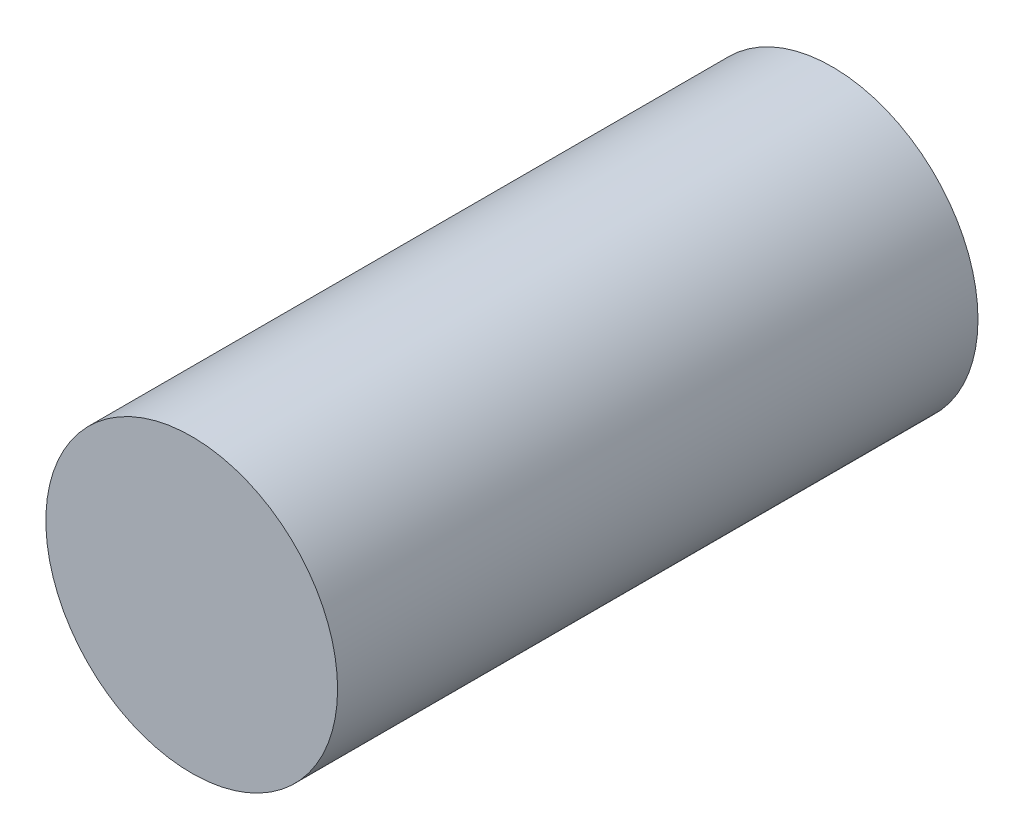
ISO-10303-21;
HEADER;
FILE_DESCRIPTION(('STEP AP214'),'2;1');
FILE_NAME('part.step','',(''),(''),'','','');
FILE_SCHEMA(('AUTOMOTIVE_DESIGN { 1 0 10303 214 1 1 1 1 }'));
ENDSEC;
DATA;
#1=APPLICATION_CONTEXT('core data for automotive mechanical design processes');
#2=APPLICATION_PROTOCOL_DEFINITION('international standard','automotive_design',2000,#1);
#3=PRODUCT_CONTEXT('',#1,'mechanical');
#4=PRODUCT('Part','Part','',(#3));
#5=PRODUCT_RELATED_PRODUCT_CATEGORY('part','',(#4));
#6=PRODUCT_DEFINITION_FORMATION('','',#4);
#7=PRODUCT_DEFINITION_CONTEXT('part definition',#1,'design');
#8=PRODUCT_DEFINITION('design','',#6,#7);
#9=PRODUCT_DEFINITION_SHAPE('','',#8);
#10=(LENGTH_UNIT() NAMED_UNIT(*) SI_UNIT(.MILLI.,.METRE.));
#11=(NAMED_UNIT(*) PLANE_ANGLE_UNIT() SI_UNIT($,.RADIAN.));
#12=(NAMED_UNIT(*) SI_UNIT($,.STERADIAN.) SOLID_ANGLE_UNIT());
#13=UNCERTAINTY_MEASURE_WITH_UNIT(LENGTH_MEASURE(1.E-05),#10,'distance_accuracy_value','');
#14=(GEOMETRIC_REPRESENTATION_CONTEXT(3) GLOBAL_UNCERTAINTY_ASSIGNED_CONTEXT((#13)) GLOBAL_UNIT_ASSIGNED_CONTEXT((#10,
#11,#12)) REPRESENTATION_CONTEXT('',''));
#15=CARTESIAN_POINT('',(0.,0.,0.));
#16=DIRECTION('',(0.,0.,1.));
#17=DIRECTION('',(1.,0.,0.));
#18=AXIS2_PLACEMENT_3D('',#15,#16,#17);
#19=CARTESIAN_POINT('',(7.62,1.27,0.1));
#20=DIRECTION('',(0.,0.,1.));
#21=DIRECTION('',(1.,0.,0.));
#22=AXIS2_PLACEMENT_3D('',#19,#20,#21);
#23=PLANE('',#22);
#24=CARTESIAN_POINT('',(7.62,1.27,0.1));
#25=DIRECTION('',(0.,0.,1.));
#26=DIRECTION('',(1.,0.,0.));
#27=AXIS2_PLACEMENT_3D('',#24,#25,#26);
#28=CIRCLE('',#27,0.41);
#29=CARTESIAN_POINT('',(8.03,1.27,0.1));
#30=VERTEX_POINT('',#29);
#31=EDGE_CURVE('E17',#30,#30,#28,.F.);
#32=ORIENTED_EDGE('',*,*,#31,.F.);
#33=EDGE_LOOP('',(#32));
#34=FACE_BOUND('',#33,.T.);
#35=ADVANCED_FACE('F14',(#34),#23,.T.);
#36=CARTESIAN_POINT('',(7.62,1.27,-1.7));
#37=DIRECTION('',(0.,0.,1.));
#38=DIRECTION('',(1.,0.,0.));
#39=AXIS2_PLACEMENT_3D('',#36,#37,#38);
#40=PLANE('',#39);
#41=CARTESIAN_POINT('',(7.62,1.27,-1.7));
#42=DIRECTION('',(0.,0.,1.));
#43=DIRECTION('',(1.,0.,0.));
#44=AXIS2_PLACEMENT_3D('',#41,#42,#43);
#45=CIRCLE('',#44,0.41);
#46=CARTESIAN_POINT('',(8.03,1.27,-1.7));
#47=VERTEX_POINT('',#46);
#48=EDGE_CURVE('E10',#47,#47,#45,.T.);
#49=ORIENTED_EDGE('',*,*,#48,.F.);
#50=EDGE_LOOP('',(#49));
#51=FACE_BOUND('',#50,.T.);
#52=ADVANCED_FACE('F29',(#51),#40,.F.);
#53=CARTESIAN_POINT('',(7.62,1.27,-1.7));
#54=DIRECTION('',(0.,0.,1.));
#55=DIRECTION('',(1.,0.,0.));
#56=AXIS2_PLACEMENT_3D('',#53,#54,#55);
#57=CYLINDRICAL_SURFACE('',#56,0.41);
#58=ORIENTED_EDGE('',*,*,#48,.T.);
#59=EDGE_LOOP('',(#58));
#60=FACE_BOUND('',#59,.T.);
#61=ORIENTED_EDGE('',*,*,#31,.T.);
#62=EDGE_LOOP('',(#61));
#63=FACE_BOUND('',#62,.T.);
#64=ADVANCED_FACE('F26',(#60,#63),#57,.T.);
#65=CLOSED_SHELL('',(#35,#52,#64));
#66=MANIFOLD_SOLID_BREP('B1',#65);
#67=ADVANCED_BREP_SHAPE_REPRESENTATION('',(#18,#66),#14);
#68=SHAPE_DEFINITION_REPRESENTATION(#9,#67);
ENDSEC;
END-ISO-10303-21;
